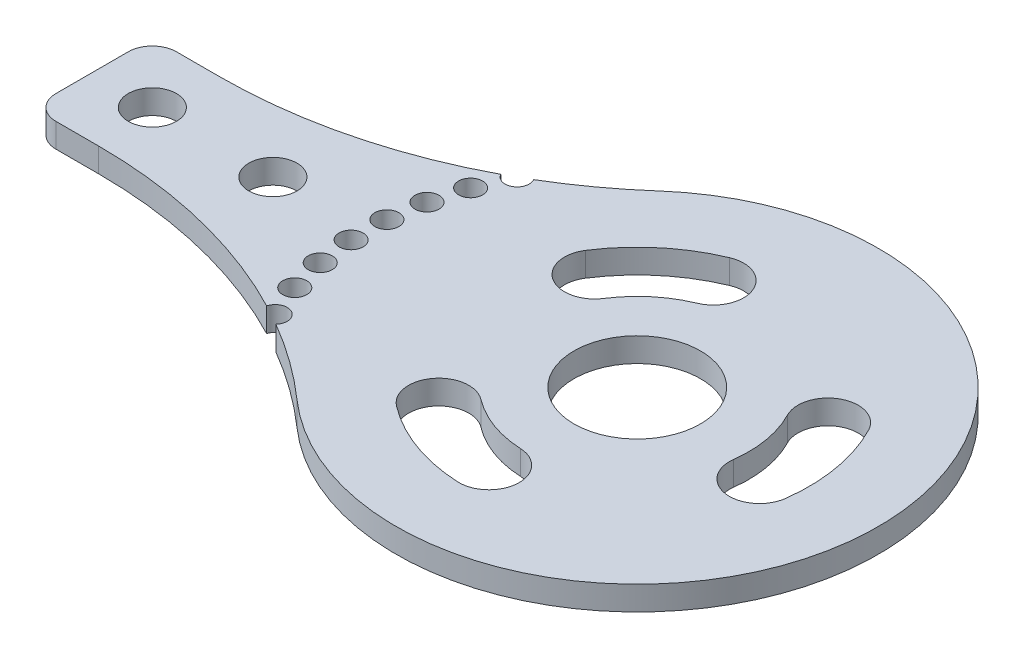
ISO-10303-21;
HEADER;
FILE_DESCRIPTION(('STEP AP214'),'2;1');
FILE_NAME('part.step','',(''),(''),'','','');
FILE_SCHEMA(('AUTOMOTIVE_DESIGN { 1 0 10303 214 1 1 1 1 }'));
ENDSEC;
DATA;
#1=APPLICATION_CONTEXT('core data for automotive mechanical design processes');
#2=APPLICATION_PROTOCOL_DEFINITION('international standard','automotive_design',2000,#1);
#3=PRODUCT_CONTEXT('',#1,'mechanical');
#4=PRODUCT('Part','Part','',(#3));
#5=PRODUCT_RELATED_PRODUCT_CATEGORY('part','',(#4));
#6=PRODUCT_DEFINITION_FORMATION('','',#4);
#7=PRODUCT_DEFINITION_CONTEXT('part definition',#1,'design');
#8=PRODUCT_DEFINITION('design','',#6,#7);
#9=PRODUCT_DEFINITION_SHAPE('','',#8);
#10=(LENGTH_UNIT() NAMED_UNIT(*) SI_UNIT(.MILLI.,.METRE.));
#11=(NAMED_UNIT(*) PLANE_ANGLE_UNIT() SI_UNIT($,.RADIAN.));
#12=(NAMED_UNIT(*) SI_UNIT($,.STERADIAN.) SOLID_ANGLE_UNIT());
#13=UNCERTAINTY_MEASURE_WITH_UNIT(LENGTH_MEASURE(1.E-05),#10,'distance_accuracy_value','');
#14=(GEOMETRIC_REPRESENTATION_CONTEXT(3) GLOBAL_UNCERTAINTY_ASSIGNED_CONTEXT((#13)) GLOBAL_UNIT_ASSIGNED_CONTEXT((#10,
#11,#12)) REPRESENTATION_CONTEXT('',''));
#15=CARTESIAN_POINT('',(0.,0.,0.));
#16=DIRECTION('',(0.,0.,1.));
#17=DIRECTION('',(1.,0.,0.));
#18=AXIS2_PLACEMENT_3D('',#15,#16,#17);
#19=CARTESIAN_POINT('',(5.5424868893541,2.,50.));
#20=DIRECTION('',(0.,-1.,0.));
#21=DIRECTION('',(0.,0.,-1.));
#22=AXIS2_PLACEMENT_3D('',#19,#20,#21);
#23=CYLINDRICAL_SURFACE('',#22,40.);
#24=CARTESIAN_POINT('',(5.5424868893541,2.,50.));
#25=DIRECTION('',(0.,-1.,0.));
#26=DIRECTION('',(0.,0.,-1.));
#27=AXIS2_PLACEMENT_3D('',#24,#25,#26);
#28=CIRCLE('',#27,40.);
#29=CARTESIAN_POINT('',(25.6994964834051,2.,15.4501090562454));
#30=VERTEX_POINT('',#29);
#31=CARTESIAN_POINT('',(32.,2.,20.));
#32=VERTEX_POINT('',#31);
#33=EDGE_CURVE('E367',#30,#32,#28,.T.);
#34=ORIENTED_EDGE('',*,*,#33,.F.);
#35=DIRECTION('',(0.,1.,0.));
#36=VECTOR('',#35,1.);
#37=CARTESIAN_POINT('',(25.6994964834051,1.,15.4501090562454));
#38=LINE('',#37,#36);
#39=CARTESIAN_POINT('',(25.6994964834051,0.,15.4501090562454));
#40=VERTEX_POINT('',#39);
#41=EDGE_CURVE('E315',#30,#40,#38,.F.);
#42=ORIENTED_EDGE('',*,*,#41,.T.);
#43=CARTESIAN_POINT('',(5.5424868893541,0.,50.));
#44=DIRECTION('',(0.,-1.,0.));
#45=DIRECTION('',(0.,0.,-1.));
#46=AXIS2_PLACEMENT_3D('',#43,#44,#45);
#47=CIRCLE('',#46,40.);
#48=CARTESIAN_POINT('',(32.,0.,20.));
#49=VERTEX_POINT('',#48);
#50=EDGE_CURVE('E362',#40,#49,#47,.T.);
#51=ORIENTED_EDGE('',*,*,#50,.T.);
#52=DIRECTION('',(0.,-1.,0.));
#53=VECTOR('',#52,1.);
#54=CARTESIAN_POINT('',(32.,2.,20.));
#55=LINE('',#54,#53);
#56=EDGE_CURVE('E423',#32,#49,#55,.T.);
#57=ORIENTED_EDGE('',*,*,#56,.F.);
#58=EDGE_LOOP('',(#34,#42,#51,#57));
#59=FACE_BOUND('',#58,.T.);
#60=ADVANCED_FACE('F36',(#59),#23,.F.);
#61=CARTESIAN_POINT('',(5.54248688935409,2.,-40.));
#62=DIRECTION('',(0.,-1.,0.));
#63=DIRECTION('',(0.,0.,-1.));
#64=AXIS2_PLACEMENT_3D('',#61,#62,#63);
#65=CYLINDRICAL_SURFACE('',#64,40.);
#66=CARTESIAN_POINT('',(5.54248688935409,2.,-40.));
#67=DIRECTION('',(0.,-1.,0.));
#68=DIRECTION('',(0.,0.,1.));
#69=AXIS2_PLACEMENT_3D('',#66,#67,#68);
#70=CIRCLE('',#69,40.);
#71=CARTESIAN_POINT('',(24.2593371705279,2.,-4.64919356574555));
#72=VERTEX_POINT('',#71);
#73=CARTESIAN_POINT('',(5.5424868893541,2.,0.));
#74=VERTEX_POINT('',#73);
#75=EDGE_CURVE('E369',#72,#74,#70,.T.);
#76=ORIENTED_EDGE('',*,*,#75,.F.);
#77=DIRECTION('',(0.,1.,0.));
#78=VECTOR('',#77,1.);
#79=CARTESIAN_POINT('',(24.2593371705279,1.,-4.64919356574555));
#80=LINE('',#79,#78);
#81=CARTESIAN_POINT('',(24.2593371705279,0.,-4.64919356574555));
#82=VERTEX_POINT('',#81);
#83=EDGE_CURVE('E359',#72,#82,#80,.F.);
#84=ORIENTED_EDGE('',*,*,#83,.T.);
#85=CARTESIAN_POINT('',(5.54248688935409,0.,-40.));
#86=DIRECTION('',(0.,-1.,0.));
#87=DIRECTION('',(0.,0.,1.));
#88=AXIS2_PLACEMENT_3D('',#85,#86,#87);
#89=CIRCLE('',#88,40.);
#90=CARTESIAN_POINT('',(5.5424868893541,0.,0.));
#91=VERTEX_POINT('',#90);
#92=EDGE_CURVE('E389',#82,#91,#89,.T.);
#93=ORIENTED_EDGE('',*,*,#92,.T.);
#94=DIRECTION('',(0.,-1.,0.));
#95=VECTOR('',#94,1.);
#96=CARTESIAN_POINT('',(5.5424868893541,2.,0.));
#97=LINE('',#96,#95);
#98=EDGE_CURVE('E417',#74,#91,#97,.T.);
#99=ORIENTED_EDGE('',*,*,#98,.F.);
#100=EDGE_LOOP('',(#76,#84,#93,#99));
#101=FACE_BOUND('',#100,.T.);
#102=ADVANCED_FACE('F434',(#101),#65,.F.);
#103=CARTESIAN_POINT('',(5.5424868893541,0.,10.));
#104=VERTEX_POINT('',#103);
#105=CARTESIAN_POINT('',(23.9976028764144,0.,14.5118513598673));
#106=VERTEX_POINT('',#105);
#107=EDGE_CURVE('E384',#104,#106,#47,.T.);
#108=ORIENTED_EDGE('',*,*,#107,.T.);
#109=DIRECTION('',(0.,1.,0.));
#110=VECTOR('',#109,1.);
#111=CARTESIAN_POINT('',(23.9976028764144,1.,14.5118513598673));
#112=LINE('',#111,#110);
#113=CARTESIAN_POINT('',(23.9976028764144,2.,14.5118513598673));
#114=VERTEX_POINT('',#113);
#115=EDGE_CURVE('E312',#106,#114,#112,.T.);
#116=ORIENTED_EDGE('',*,*,#115,.T.);
#117=CARTESIAN_POINT('',(5.5424868893541,2.,10.));
#118=VERTEX_POINT('',#117);
#119=EDGE_CURVE('E363',#118,#114,#28,.T.);
#120=ORIENTED_EDGE('',*,*,#119,.F.);
#121=DIRECTION('',(0.,-1.,0.));
#122=VECTOR('',#121,1.);
#123=CARTESIAN_POINT('',(5.5424868893541,2.,10.));
#124=LINE('',#123,#122);
#125=EDGE_CURVE('E383',#118,#104,#124,.T.);
#126=ORIENTED_EDGE('',*,*,#125,.T.);
#127=EDGE_LOOP('',(#108,#116,#120,#126));
#128=FACE_BOUND('',#127,.T.);
#129=ADVANCED_FACE('F38',(#128),#23,.F.);
#130=CARTESIAN_POINT('',(45.228756555323,2.,5.));
#131=DIRECTION('',(0.,-1.,0.));
#132=DIRECTION('',(0.,0.,-1.));
#133=AXIS2_PLACEMENT_3D('',#130,#131,#132);
#134=CYLINDRICAL_SURFACE('',#133,20.);
#135=CARTESIAN_POINT('',(45.228756555323,0.,5.));
#136=DIRECTION('',(0.,1.,0.));
#137=DIRECTION('',(0.,0.,1.));
#138=AXIS2_PLACEMENT_3D('',#135,#136,#137);
#139=CIRCLE('',#138,20.);
#140=CARTESIAN_POINT('',(32.,0.,-10.));
#141=VERTEX_POINT('',#140);
#142=EDGE_CURVE('E387',#49,#141,#139,.T.);
#143=ORIENTED_EDGE('',*,*,#142,.T.);
#144=DIRECTION('',(0.,-1.,0.));
#145=VECTOR('',#144,1.);
#146=CARTESIAN_POINT('',(32.,2.,-10.));
#147=LINE('',#146,#145);
#148=CARTESIAN_POINT('',(32.,2.,-10.));
#149=VERTEX_POINT('',#148);
#150=EDGE_CURVE('E420',#149,#141,#147,.T.);
#151=ORIENTED_EDGE('',*,*,#150,.F.);
#152=CARTESIAN_POINT('',(45.228756555323,2.,5.));
#153=DIRECTION('',(0.,1.,0.));
#154=DIRECTION('',(0.,0.,1.));
#155=AXIS2_PLACEMENT_3D('',#152,#153,#154);
#156=CIRCLE('',#155,20.);
#157=EDGE_CURVE('E366',#32,#149,#156,.T.);
#158=ORIENTED_EDGE('',*,*,#157,.F.);
#159=ORIENTED_EDGE('',*,*,#56,.T.);
#160=EDGE_LOOP('',(#143,#151,#158,#159));
#161=FACE_BOUND('',#160,.T.);
#162=ADVANCED_FACE('F462',(#161),#134,.T.);
#163=CARTESIAN_POINT('',(26.0027946773458,0.,-5.62885213990304));
#164=VERTEX_POINT('',#163);
#165=EDGE_CURVE('E390',#141,#164,#89,.T.);
#166=ORIENTED_EDGE('',*,*,#165,.T.);
#167=DIRECTION('',(0.,1.,0.));
#168=VECTOR('',#167,1.);
#169=CARTESIAN_POINT('',(26.0027946773458,1.,-5.62885213990304));
#170=LINE('',#169,#168);
#171=CARTESIAN_POINT('',(26.0027946773458,2.,-5.62885213990304));
#172=VERTEX_POINT('',#171);
#173=EDGE_CURVE('E356',#164,#172,#170,.T.);
#174=ORIENTED_EDGE('',*,*,#173,.T.);
#175=EDGE_CURVE('E370',#149,#172,#70,.T.);
#176=ORIENTED_EDGE('',*,*,#175,.F.);
#177=ORIENTED_EDGE('',*,*,#150,.T.);
#178=EDGE_LOOP('',(#166,#174,#176,#177));
#179=FACE_BOUND('',#178,.T.);
#180=ADVANCED_FACE('F455',(#179),#65,.F.);
#181=CARTESIAN_POINT('',(2.00000000000001,2.,0.));
#182=DIRECTION('',(0.,0.,1.));
#183=DIRECTION('',(1.,0.,0.));
#184=AXIS2_PLACEMENT_3D('',#181,#182,#183);
#185=PLANE('',#184);
#186=DIRECTION('',(-1.,0.,0.));
#187=VECTOR('',#186,1.);
#188=CARTESIAN_POINT('',(2.00000000000001,0.,0.));
#189=LINE('',#188,#187);
#190=CARTESIAN_POINT('',(2.00000000000001,0.,0.));
#191=VERTEX_POINT('',#190);
#192=EDGE_CURVE('E393',#91,#191,#189,.T.);
#193=ORIENTED_EDGE('',*,*,#192,.T.);
#194=DIRECTION('',(0.,-1.,0.));
#195=VECTOR('',#194,1.);
#196=CARTESIAN_POINT('',(2.00000000000001,2.,0.));
#197=LINE('',#196,#195);
#198=CARTESIAN_POINT('',(2.00000000000001,2.,0.));
#199=VERTEX_POINT('',#198);
#200=EDGE_CURVE('E414',#199,#191,#197,.T.);
#201=ORIENTED_EDGE('',*,*,#200,.F.);
#202=DIRECTION('',(-1.,0.,0.));
#203=VECTOR('',#202,1.);
#204=CARTESIAN_POINT('',(2.00000000000001,2.,0.));
#205=LINE('',#204,#203);
#206=EDGE_CURVE('E373',#74,#199,#205,.T.);
#207=ORIENTED_EDGE('',*,*,#206,.F.);
#208=ORIENTED_EDGE('',*,*,#98,.T.);
#209=EDGE_LOOP('',(#193,#201,#207,#208));
#210=FACE_BOUND('',#209,.T.);
#211=ADVANCED_FACE('F443',(#210),#185,.F.);
#212=CARTESIAN_POINT('',(2.,2.,2.));
#213=DIRECTION('',(0.,-1.,0.));
#214=DIRECTION('',(0.,0.,-1.));
#215=AXIS2_PLACEMENT_3D('',#212,#213,#214);
#216=CYLINDRICAL_SURFACE('',#215,2.);
#217=CARTESIAN_POINT('',(2.,0.,2.));
#218=DIRECTION('',(0.,1.,0.));
#219=DIRECTION('',(0.,0.,-1.));
#220=AXIS2_PLACEMENT_3D('',#217,#218,#219);
#221=CIRCLE('',#220,2.);
#222=CARTESIAN_POINT('',(0.,0.,2.00000000000001));
#223=VERTEX_POINT('',#222);
#224=EDGE_CURVE('E395',#191,#223,#221,.T.);
#225=ORIENTED_EDGE('',*,*,#224,.T.);
#226=DIRECTION('',(0.,-1.,0.));
#227=VECTOR('',#226,1.);
#228=CARTESIAN_POINT('',(0.,2.,2.00000000000001));
#229=LINE('',#228,#227);
#230=CARTESIAN_POINT('',(0.,2.,2.00000000000001));
#231=VERTEX_POINT('',#230);
#232=EDGE_CURVE('E411',#231,#223,#229,.T.);
#233=ORIENTED_EDGE('',*,*,#232,.F.);
#234=CARTESIAN_POINT('',(2.,2.,2.));
#235=DIRECTION('',(0.,1.,0.));
#236=DIRECTION('',(0.,0.,-1.));
#237=AXIS2_PLACEMENT_3D('',#234,#235,#236);
#238=CIRCLE('',#237,2.);
#239=EDGE_CURVE('E375',#199,#231,#238,.T.);
#240=ORIENTED_EDGE('',*,*,#239,.F.);
#241=ORIENTED_EDGE('',*,*,#200,.T.);
#242=EDGE_LOOP('',(#225,#233,#240,#241));
#243=FACE_BOUND('',#242,.T.);
#244=ADVANCED_FACE('F447',(#243),#216,.T.);
#245=CARTESIAN_POINT('',(0.,2.,2.00000000000001));
#246=DIRECTION('',(1.,0.,0.));
#247=DIRECTION('',(0.,0.,-1.));
#248=AXIS2_PLACEMENT_3D('',#245,#246,#247);
#249=PLANE('',#248);
#250=DIRECTION('',(0.,0.,1.));
#251=VECTOR('',#250,1.);
#252=CARTESIAN_POINT('',(0.,0.,2.00000000000001));
#253=LINE('',#252,#251);
#254=CARTESIAN_POINT('',(0.,0.,7.99999999999999));
#255=VERTEX_POINT('',#254);
#256=EDGE_CURVE('E397',#223,#255,#253,.T.);
#257=ORIENTED_EDGE('',*,*,#256,.T.);
#258=DIRECTION('',(0.,-1.,0.));
#259=VECTOR('',#258,1.);
#260=CARTESIAN_POINT('',(0.,2.,7.99999999999999));
#261=LINE('',#260,#259);
#262=CARTESIAN_POINT('',(0.,2.,7.99999999999999));
#263=VERTEX_POINT('',#262);
#264=EDGE_CURVE('E408',#263,#255,#261,.T.);
#265=ORIENTED_EDGE('',*,*,#264,.F.);
#266=DIRECTION('',(0.,0.,1.));
#267=VECTOR('',#266,1.);
#268=CARTESIAN_POINT('',(0.,2.,2.00000000000001));
#269=LINE('',#268,#267);
#270=EDGE_CURVE('E377',#231,#263,#269,.T.);
#271=ORIENTED_EDGE('',*,*,#270,.F.);
#272=ORIENTED_EDGE('',*,*,#232,.T.);
#273=EDGE_LOOP('',(#257,#265,#271,#272));
#274=FACE_BOUND('',#273,.T.);
#275=ADVANCED_FACE('F482',(#274),#249,.F.);
#276=CARTESIAN_POINT('',(2.,2.,8.));
#277=DIRECTION('',(0.,-1.,0.));
#278=DIRECTION('',(0.,0.,-1.));
#279=AXIS2_PLACEMENT_3D('',#276,#277,#278);
#280=CYLINDRICAL_SURFACE('',#279,2.);
#281=CARTESIAN_POINT('',(2.,0.,8.));
#282=DIRECTION('',(0.,1.,0.));
#283=DIRECTION('',(0.,0.,1.));
#284=AXIS2_PLACEMENT_3D('',#281,#282,#283);
#285=CIRCLE('',#284,2.);
#286=CARTESIAN_POINT('',(2.00000000000002,0.,10.));
#287=VERTEX_POINT('',#286);
#288=EDGE_CURVE('E399',#255,#287,#285,.T.);
#289=ORIENTED_EDGE('',*,*,#288,.T.);
#290=DIRECTION('',(0.,-1.,0.));
#291=VECTOR('',#290,1.);
#292=CARTESIAN_POINT('',(2.00000000000002,2.,10.));
#293=LINE('',#292,#291);
#294=CARTESIAN_POINT('',(2.00000000000002,2.,10.));
#295=VERTEX_POINT('',#294);
#296=EDGE_CURVE('E405',#295,#287,#293,.T.);
#297=ORIENTED_EDGE('',*,*,#296,.F.);
#298=CARTESIAN_POINT('',(2.,2.,8.));
#299=DIRECTION('',(0.,1.,0.));
#300=DIRECTION('',(0.,0.,1.));
#301=AXIS2_PLACEMENT_3D('',#298,#299,#300);
#302=CIRCLE('',#301,2.);
#303=EDGE_CURVE('E379',#263,#295,#302,.T.);
#304=ORIENTED_EDGE('',*,*,#303,.F.);
#305=ORIENTED_EDGE('',*,*,#264,.T.);
#306=EDGE_LOOP('',(#289,#297,#304,#305));
#307=FACE_BOUND('',#306,.T.);
#308=ADVANCED_FACE('F480',(#307),#280,.T.);
#309=CARTESIAN_POINT('',(2.00000000000002,2.,10.));
#310=DIRECTION('',(0.,0.,-1.));
#311=DIRECTION('',(-1.,0.,0.));
#312=AXIS2_PLACEMENT_3D('',#309,#310,#311);
#313=PLANE('',#312);
#314=DIRECTION('',(1.,0.,0.));
#315=VECTOR('',#314,1.);
#316=CARTESIAN_POINT('',(2.00000000000002,0.,10.));
#317=LINE('',#316,#315);
#318=EDGE_CURVE('E401',#287,#104,#317,.T.);
#319=ORIENTED_EDGE('',*,*,#318,.T.);
#320=ORIENTED_EDGE('',*,*,#125,.F.);
#321=DIRECTION('',(1.,0.,0.));
#322=VECTOR('',#321,1.);
#323=CARTESIAN_POINT('',(2.00000000000002,2.,10.));
#324=LINE('',#323,#322);
#325=EDGE_CURVE('E381',#295,#118,#324,.T.);
#326=ORIENTED_EDGE('',*,*,#325,.F.);
#327=ORIENTED_EDGE('',*,*,#296,.T.);
#328=EDGE_LOOP('',(#319,#320,#326,#327));
#329=FACE_BOUND('',#328,.T.);
#330=ADVANCED_FACE('F476',(#329),#313,.F.);
#331=CARTESIAN_POINT('',(5.5424868893541,2.,50.));
#332=DIRECTION('',(0.,-1.,0.));
#333=DIRECTION('',(0.,0.,-1.));
#334=AXIS2_PLACEMENT_3D('',#331,#332,#333);
#335=PLANE('',#334);
#336=CARTESIAN_POINT('',(45.228756555323,2.,5.));
#337=DIRECTION('',(0.,1.,0.));
#338=DIRECTION('',(0.,0.,1.));
#339=AXIS2_PLACEMENT_3D('',#336,#337,#338);
#340=CIRCLE('',#339,5.25);
#341=CARTESIAN_POINT('',(45.228756555323,2.,10.25));
#342=VERTEX_POINT('',#341);
#343=EDGE_CURVE('E220',#342,#342,#340,.T.);
#344=ORIENTED_EDGE('',*,*,#343,.F.);
#345=EDGE_LOOP('',(#344));
#346=FACE_BOUND('',#345,.T.);
#347=CARTESIAN_POINT('',(45.228756555323,2.,5.));
#348=DIRECTION('',(0.,1.,0.));
#349=DIRECTION('',(-0.866025403784443,0.,-0.499999999999992));
#350=AXIS2_PLACEMENT_3D('',#347,#348,#349);
#351=CIRCLE('',#350,9.2498831504514);
#352=CARTESIAN_POINT('',(54.402108574257,2.,6.18741359000272));
#353=VERTEX_POINT('',#352);
#354=CARTESIAN_POINT('',(53.4495007890298,2.,0.759752066095645));
#355=VERTEX_POINT('',#354);
#356=EDGE_CURVE('E226',#353,#355,#351,.T.);
#357=ORIENTED_EDGE('',*,*,#356,.T.);
#358=CARTESIAN_POINT('',(55.6713516221686,2.,-0.386275366071824));
#359=DIRECTION('',(0.,1.,0.));
#360=DIRECTION('',(-0.866025403784443,0.,-0.499999999999992));
#361=AXIS2_PLACEMENT_3D('',#358,#359,#360);
#362=CIRCLE('',#361,2.5);
#363=CARTESIAN_POINT('',(57.8932024553075,2.,-1.53230279823927));
#364=VERTEX_POINT('',#363);
#365=EDGE_CURVE('E51',#364,#355,#362,.T.);
#366=ORIENTED_EDGE('',*,*,#365,.F.);
#367=CARTESIAN_POINT('',(45.228756555323,2.,5.));
#368=DIRECTION('',(0.,1.,0.));
#369=DIRECTION('',(-0.866025403784443,0.,-0.499999999999992));
#370=AXIS2_PLACEMENT_3D('',#367,#368,#369);
#371=CIRCLE('',#370,14.2498831504514);
#372=CARTESIAN_POINT('',(59.3607398724731,2.,6.82926688192499));
#373=VERTEX_POINT('',#372);
#374=EDGE_CURVE('E214',#373,#364,#371,.T.);
#375=ORIENTED_EDGE('',*,*,#374,.F.);
#376=CARTESIAN_POINT('',(56.8814242233651,2.,6.50834023596385));
#377=DIRECTION('',(0.,1.,0.));
#378=DIRECTION('',(-0.866025403784443,0.,-0.499999999999992));
#379=AXIS2_PLACEMENT_3D('',#376,#377,#378);
#380=CIRCLE('',#379,2.5);
#381=EDGE_CURVE('E217',#353,#373,#380,.T.);
#382=ORIENTED_EDGE('',*,*,#381,.F.);
#383=EDGE_LOOP('',(#357,#366,#375,#382));
#384=FACE_BOUND('',#383,.T.);
#385=CARTESIAN_POINT('',(45.228756555323,2.,5.));
#386=DIRECTION('',(0.,1.,0.));
#387=DIRECTION('',(0.866025403784436,0.,-0.500000000000004));
#388=AXIS2_PLACEMENT_3D('',#385,#386,#387);
#389=CIRCLE('',#388,9.2498831504514);
#390=CARTESIAN_POINT('',(39.6137502121147,2.,12.3506490912528));
#391=VERTEX_POINT('',#390);
#392=CARTESIAN_POINT('',(44.7905468675751,2.,14.2394973113568));
#393=VERTEX_POINT('',#392);
#394=EDGE_CURVE('E251',#391,#393,#389,.T.);
#395=ORIENTED_EDGE('',*,*,#394,.T.);
#396=CARTESIAN_POINT('',(44.6721103206966,2.,16.7366902923583));
#397=DIRECTION('',(0.,1.,0.));
#398=DIRECTION('',(0.866025403784436,0.,-0.500000000000004));
#399=AXIS2_PLACEMENT_3D('',#396,#397,#398);
#400=CIRCLE('',#399,2.5);
#401=CARTESIAN_POINT('',(44.553673773818,2.,19.2338832733599));
#402=VERTEX_POINT('',#401);
#403=EDGE_CURVE('E233',#402,#393,#400,.T.);
#404=ORIENTED_EDGE('',*,*,#403,.F.);
#405=CARTESIAN_POINT('',(45.228756555323,2.,5.));
#406=DIRECTION('',(0.,1.,0.));
#407=DIRECTION('',(0.866025403784436,0.,-0.500000000000004));
#408=AXIS2_PLACEMENT_3D('',#405,#406,#407);
#409=CIRCLE('',#408,14.2498831504514);
#410=CARTESIAN_POINT('',(36.5785733066992,2.,16.3240231175474));
#411=VERTEX_POINT('',#410);
#412=EDGE_CURVE('E241',#411,#402,#409,.T.);
#413=ORIENTED_EDGE('',*,*,#412,.F.);
#414=CARTESIAN_POINT('',(38.096161759407,2.,14.3373361044001));
#415=DIRECTION('',(0.,1.,0.));
#416=DIRECTION('',(0.866025403784436,0.,-0.500000000000004));
#417=AXIS2_PLACEMENT_3D('',#414,#415,#416);
#418=CIRCLE('',#417,2.5);
#419=EDGE_CURVE('E254',#391,#411,#418,.T.);
#420=ORIENTED_EDGE('',*,*,#419,.F.);
#421=EDGE_LOOP('',(#395,#404,#413,#420));
#422=FACE_BOUND('',#421,.T.);
#423=CARTESIAN_POINT('',(45.228756555323,2.,5.));
#424=DIRECTION('',(0.,1.,0.));
#425=DIRECTION('',(0.,0.,1.));
#426=AXIS2_PLACEMENT_3D('',#423,#424,#425);
#427=CIRCLE('',#426,9.2498831504514);
#428=CARTESIAN_POINT('',(41.6704108795972,2.,-3.53806268125556));
#429=VERTEX_POINT('',#428);
#430=CARTESIAN_POINT('',(37.4462220093639,2.,0.000750622547521229));
#431=VERTEX_POINT('',#430);
#432=EDGE_CURVE('E282',#429,#431,#427,.T.);
#433=ORIENTED_EDGE('',*,*,#432,.T.);
#434=CARTESIAN_POINT('',(35.3428077231037,2.,-1.3504149262866));
#435=DIRECTION('',(0.,1.,0.));
#436=DIRECTION('',(0.,0.,1.));
#437=AXIS2_PLACEMENT_3D('',#434,#435,#436);
#438=CIRCLE('',#437,2.5);
#439=CARTESIAN_POINT('',(33.2393934368434,2.,-2.70158047512074));
#440=VERTEX_POINT('',#439);
#441=EDGE_CURVE('E261',#440,#431,#438,.T.);
#442=ORIENTED_EDGE('',*,*,#441,.F.);
#443=CARTESIAN_POINT('',(45.228756555323,2.,5.));
#444=DIRECTION('',(0.,1.,0.));
#445=DIRECTION('',(0.,0.,1.));
#446=AXIS2_PLACEMENT_3D('',#443,#444,#445);
#447=CIRCLE('',#446,14.2498831504514);
#448=CARTESIAN_POINT('',(39.7469564867966,2.,-8.15328999947249));
#449=VERTEX_POINT('',#448);
#450=EDGE_CURVE('E272',#449,#440,#447,.T.);
#451=ORIENTED_EDGE('',*,*,#450,.F.);
#452=CARTESIAN_POINT('',(40.7086836831969,2.,-5.84567634036403));
#453=DIRECTION('',(0.,1.,0.));
#454=DIRECTION('',(0.,0.,1.));
#455=AXIS2_PLACEMENT_3D('',#452,#453,#454);
#456=CIRCLE('',#455,2.5);
#457=EDGE_CURVE('E285',#429,#449,#456,.T.);
#458=ORIENTED_EDGE('',*,*,#457,.F.);
#459=EDGE_LOOP('',(#433,#442,#451,#458));
#460=FACE_BOUND('',#459,.T.);
#461=CARTESIAN_POINT('',(15.,2.,5.));
#462=DIRECTION('',(0.,1.,0.));
#463=DIRECTION('',(0.,0.,1.));
#464=AXIS2_PLACEMENT_3D('',#461,#462,#463);
#465=CIRCLE('',#464,2.);
#466=CARTESIAN_POINT('',(15.,2.,7.));
#467=VERTEX_POINT('',#466);
#468=EDGE_CURVE('E292',#467,#467,#465,.T.);
#469=ORIENTED_EDGE('',*,*,#468,.F.);
#470=EDGE_LOOP('',(#469));
#471=FACE_BOUND('',#470,.T.);
#472=CARTESIAN_POINT('',(5.,2.,5.));
#473=DIRECTION('',(0.,1.,0.));
#474=DIRECTION('',(0.,0.,1.));
#475=AXIS2_PLACEMENT_3D('',#472,#473,#474);
#476=CIRCLE('',#475,2.);
#477=CARTESIAN_POINT('',(5.,2.,7.));
#478=VERTEX_POINT('',#477);
#479=EDGE_CURVE('E302',#478,#478,#476,.T.);
#480=ORIENTED_EDGE('',*,*,#479,.F.);
#481=EDGE_LOOP('',(#480));
#482=FACE_BOUND('',#481,.T.);
#483=CARTESIAN_POINT('',(23.8602069366979,2.,12.0452173278302));
#484=DIRECTION('',(0.,1.,0.));
#485=DIRECTION('',(0.707106781186549,0.,0.707106781186546));
#486=AXIS2_PLACEMENT_3D('',#483,#484,#485);
#487=CIRCLE('',#486,0.999999999999998);
#488=CARTESIAN_POINT('',(24.5673137178845,2.,12.7523241090168));
#489=VERTEX_POINT('',#488);
#490=EDGE_CURVE('E318',#489,#489,#487,.T.);
#491=ORIENTED_EDGE('',*,*,#490,.F.);
#492=EDGE_LOOP('',(#491));
#493=FACE_BOUND('',#492,.T.);
#494=CARTESIAN_POINT('',(23.1234324497615,2.,9.19578910195463));
#495=DIRECTION('',(0.,1.,0.));
#496=DIRECTION('',(0.608761429008722,0.,0.793353340291234));
#497=AXIS2_PLACEMENT_3D('',#494,#495,#496);
#498=CIRCLE('',#497,0.999999999999998);
#499=CARTESIAN_POINT('',(23.7321938787702,2.,9.98914244224586));
#500=VERTEX_POINT('',#499);
#501=EDGE_CURVE('E322',#500,#500,#498,.T.);
#502=ORIENTED_EDGE('',*,*,#501,.F.);
#503=EDGE_LOOP('',(#502));
#504=FACE_BOUND('',#503,.T.);
#505=CARTESIAN_POINT('',(22.7648861870249,2.,6.27456976125209));
#506=DIRECTION('',(0.,1.,0.));
#507=DIRECTION('',(0.500000000000001,0.,0.866025403784438));
#508=AXIS2_PLACEMENT_3D('',#505,#506,#507);
#509=CIRCLE('',#508,0.999999999999998);
#510=CARTESIAN_POINT('',(23.2648861870249,2.,7.14059516503652));
#511=VERTEX_POINT('',#510);
#512=EDGE_CURVE('E328',#511,#511,#509,.T.);
#513=ORIENTED_EDGE('',*,*,#512,.F.);
#514=EDGE_LOOP('',(#513));
#515=FACE_BOUND('',#514,.T.);
#516=CARTESIAN_POINT('',(22.7907029744513,2.,3.33154217855702));
#517=DIRECTION('',(0.,1.,0.));
#518=DIRECTION('',(0.382683432365091,0.,0.923879532511287));
#519=AXIS2_PLACEMENT_3D('',#516,#517,#518);
#520=CIRCLE('',#519,0.999999999999998);
#521=CARTESIAN_POINT('',(23.1733864068164,2.,4.25542171106831));
#522=VERTEX_POINT('',#521);
#523=EDGE_CURVE('E334',#522,#522,#520,.T.);
#524=ORIENTED_EDGE('',*,*,#523,.F.);
#525=EDGE_LOOP('',(#524));
#526=FACE_BOUND('',#525,.T.);
#527=CARTESIAN_POINT('',(23.2004410796503,2.,0.417062371770745));
#528=DIRECTION('',(0.,1.,0.));
#529=DIRECTION('',(0.258819045102521,0.,0.965925826289068));
#530=AXIS2_PLACEMENT_3D('',#527,#528,#529);
#531=CIRCLE('',#530,0.999999999999998);
#532=CARTESIAN_POINT('',(23.4592601247528,2.,1.38298819805981));
#533=VERTEX_POINT('',#532);
#534=EDGE_CURVE('E340',#533,#533,#531,.T.);
#535=ORIENTED_EDGE('',*,*,#534,.F.);
#536=EDGE_LOOP('',(#535));
#537=FACE_BOUND('',#536,.T.);
#538=CARTESIAN_POINT('',(23.9870897700409,2.,-2.41900210156617));
#539=DIRECTION('',(0.,1.,0.));
#540=DIRECTION('',(0.130526192220052,0.,0.99144486137381));
#541=AXIS2_PLACEMENT_3D('',#538,#539,#540);
#542=CIRCLE('',#541,0.999999999999998);
#543=CARTESIAN_POINT('',(24.1176159622609,2.,-1.42755724019236));
#544=VERTEX_POINT('',#543);
#545=EDGE_CURVE('E346',#544,#544,#542,.T.);
#546=ORIENTED_EDGE('',*,*,#545,.F.);
#547=EDGE_LOOP('',(#546));
#548=FACE_BOUND('',#547,.T.);
#549=ORIENTED_EDGE('',*,*,#119,.T.);
#550=CARTESIAN_POINT('',(24.9626032320903,2.,14.7740999319234));
#551=DIRECTION('',(0.,1.,0.));
#552=DIRECTION('',(0.793353340291236,0.,0.608761429008719));
#553=AXIS2_PLACEMENT_3D('',#550,#551,#552);
#554=CIRCLE('',#553,0.999999999999998);
#555=EDGE_CURVE('E308',#30,#114,#554,.T.);
#556=ORIENTED_EDGE('',*,*,#555,.F.);
#557=ORIENTED_EDGE('',*,*,#33,.T.);
#558=ORIENTED_EDGE('',*,*,#157,.T.);
#559=ORIENTED_EDGE('',*,*,#175,.T.);
#560=CARTESIAN_POINT('',(25.1371892684303,2.,-5.1281253920093));
#561=DIRECTION('',(0.,1.,0.));
#562=DIRECTION('',(0.,0.,1.));
#563=AXIS2_PLACEMENT_3D('',#560,#561,#562);
#564=CIRCLE('',#563,0.999999999999998);
#565=EDGE_CURVE('E352',#72,#172,#564,.T.);
#566=ORIENTED_EDGE('',*,*,#565,.F.);
#567=ORIENTED_EDGE('',*,*,#75,.T.);
#568=ORIENTED_EDGE('',*,*,#206,.T.);
#569=ORIENTED_EDGE('',*,*,#239,.T.);
#570=ORIENTED_EDGE('',*,*,#270,.T.);
#571=ORIENTED_EDGE('',*,*,#303,.T.);
#572=ORIENTED_EDGE('',*,*,#325,.T.);
#573=EDGE_LOOP('',(#549,#556,#557,#558,#559,#566,#567,#568,#569,#570,#571,#572));
#574=FACE_BOUND('',#573,.T.);
#575=ADVANCED_FACE('F451',(#346,#384,#422,#460,#471,#482,#493,#504,#515,#526,#537,#548,#574),
#335,.F.);
#576=CARTESIAN_POINT('',(5.5424868893541,0.,50.));
#577=DIRECTION('',(0.,-1.,0.));
#578=DIRECTION('',(0.,0.,-1.));
#579=AXIS2_PLACEMENT_3D('',#576,#577,#578);
#580=PLANE('',#579);
#581=CARTESIAN_POINT('',(45.228756555323,0.,5.));
#582=DIRECTION('',(0.,1.,0.));
#583=DIRECTION('',(0.,0.,1.));
#584=AXIS2_PLACEMENT_3D('',#581,#582,#583);
#585=CIRCLE('',#584,5.25);
#586=CARTESIAN_POINT('',(45.228756555323,0.,10.25));
#587=VERTEX_POINT('',#586);
#588=EDGE_CURVE('E227',#587,#587,#585,.T.);
#589=ORIENTED_EDGE('',*,*,#588,.T.);
#590=EDGE_LOOP('',(#589));
#591=FACE_BOUND('',#590,.T.);
#592=CARTESIAN_POINT('',(55.6713516221686,0.,-0.386275366071824));
#593=DIRECTION('',(0.,1.,0.));
#594=DIRECTION('',(-0.866025403784443,0.,-0.499999999999992));
#595=AXIS2_PLACEMENT_3D('',#592,#593,#594);
#596=CIRCLE('',#595,2.5);
#597=CARTESIAN_POINT('',(57.8932024553075,0.,-1.53230279823927));
#598=VERTEX_POINT('',#597);
#599=CARTESIAN_POINT('',(53.4495007890298,0.,0.759752066095645));
#600=VERTEX_POINT('',#599);
#601=EDGE_CURVE('E204',#598,#600,#596,.T.);
#602=ORIENTED_EDGE('',*,*,#601,.T.);
#603=CARTESIAN_POINT('',(45.228756555323,0.,5.));
#604=DIRECTION('',(0.,1.,0.));
#605=DIRECTION('',(-0.866025403784443,0.,-0.499999999999992));
#606=AXIS2_PLACEMENT_3D('',#603,#604,#605);
#607=CIRCLE('',#606,9.2498831504514);
#608=CARTESIAN_POINT('',(54.402108574257,0.,6.18741359000272));
#609=VERTEX_POINT('',#608);
#610=EDGE_CURVE('E196',#609,#600,#607,.T.);
#611=ORIENTED_EDGE('',*,*,#610,.F.);
#612=CARTESIAN_POINT('',(56.8814242233651,0.,6.50834023596385));
#613=DIRECTION('',(0.,1.,0.));
#614=DIRECTION('',(-0.866025403784443,0.,-0.499999999999992));
#615=AXIS2_PLACEMENT_3D('',#612,#613,#614);
#616=CIRCLE('',#615,2.5);
#617=CARTESIAN_POINT('',(59.3607398724731,0.,6.82926688192499));
#618=VERTEX_POINT('',#617);
#619=EDGE_CURVE('E59',#609,#618,#616,.T.);
#620=ORIENTED_EDGE('',*,*,#619,.T.);
#621=CARTESIAN_POINT('',(45.228756555323,0.,5.));
#622=DIRECTION('',(0.,1.,0.));
#623=DIRECTION('',(-0.866025403784443,0.,-0.499999999999992));
#624=AXIS2_PLACEMENT_3D('',#621,#622,#623);
#625=CIRCLE('',#624,14.2498831504514);
#626=EDGE_CURVE('E209',#618,#598,#625,.T.);
#627=ORIENTED_EDGE('',*,*,#626,.T.);
#628=EDGE_LOOP('',(#602,#611,#620,#627));
#629=FACE_BOUND('',#628,.T.);
#630=CARTESIAN_POINT('',(44.6721103206966,0.,16.7366902923583));
#631=DIRECTION('',(0.,1.,0.));
#632=DIRECTION('',(0.866025403784436,0.,-0.500000000000004));
#633=AXIS2_PLACEMENT_3D('',#630,#631,#632);
#634=CIRCLE('',#633,2.5);
#635=CARTESIAN_POINT('',(44.553673773818,0.,19.2338832733599));
#636=VERTEX_POINT('',#635);
#637=CARTESIAN_POINT('',(44.7905468675751,0.,14.2394973113568));
#638=VERTEX_POINT('',#637);
#639=EDGE_CURVE('E237',#636,#638,#634,.T.);
#640=ORIENTED_EDGE('',*,*,#639,.T.);
#641=CARTESIAN_POINT('',(45.228756555323,0.,5.));
#642=DIRECTION('',(0.,1.,0.));
#643=DIRECTION('',(0.866025403784436,0.,-0.500000000000004));
#644=AXIS2_PLACEMENT_3D('',#641,#642,#643);
#645=CIRCLE('',#644,9.2498831504514);
#646=CARTESIAN_POINT('',(39.6137502121147,0.,12.3506490912528));
#647=VERTEX_POINT('',#646);
#648=EDGE_CURVE('E240',#647,#638,#645,.T.);
#649=ORIENTED_EDGE('',*,*,#648,.F.);
#650=CARTESIAN_POINT('',(38.096161759407,0.,14.3373361044001));
#651=DIRECTION('',(0.,1.,0.));
#652=DIRECTION('',(0.866025403784436,0.,-0.500000000000004));
#653=AXIS2_PLACEMENT_3D('',#650,#651,#652);
#654=CIRCLE('',#653,2.5);
#655=CARTESIAN_POINT('',(36.5785733066992,0.,16.3240231175474));
#656=VERTEX_POINT('',#655);
#657=EDGE_CURVE('E243',#647,#656,#654,.T.);
#658=ORIENTED_EDGE('',*,*,#657,.T.);
#659=CARTESIAN_POINT('',(45.228756555323,0.,5.));
#660=DIRECTION('',(0.,1.,0.));
#661=DIRECTION('',(0.866025403784436,0.,-0.500000000000004));
#662=AXIS2_PLACEMENT_3D('',#659,#660,#661);
#663=CIRCLE('',#662,14.2498831504514);
#664=EDGE_CURVE('E246',#656,#636,#663,.T.);
#665=ORIENTED_EDGE('',*,*,#664,.T.);
#666=EDGE_LOOP('',(#640,#649,#658,#665));
#667=FACE_BOUND('',#666,.T.);
#668=CARTESIAN_POINT('',(35.3428077231037,0.,-1.3504149262866));
#669=DIRECTION('',(0.,1.,0.));
#670=DIRECTION('',(0.,0.,1.));
#671=AXIS2_PLACEMENT_3D('',#668,#669,#670);
#672=CIRCLE('',#671,2.5);
#673=CARTESIAN_POINT('',(33.2393934368434,0.,-2.70158047512074));
#674=VERTEX_POINT('',#673);
#675=CARTESIAN_POINT('',(37.4462220093639,0.,0.000750622547519494));
#676=VERTEX_POINT('',#675);
#677=EDGE_CURVE('E268',#674,#676,#672,.T.);
#678=ORIENTED_EDGE('',*,*,#677,.T.);
#679=CARTESIAN_POINT('',(45.228756555323,0.,5.));
#680=DIRECTION('',(0.,1.,0.));
#681=DIRECTION('',(0.,0.,1.));
#682=AXIS2_PLACEMENT_3D('',#679,#680,#681);
#683=CIRCLE('',#682,9.2498831504514);
#684=CARTESIAN_POINT('',(41.6704108795972,0.,-3.53806268125556));
#685=VERTEX_POINT('',#684);
#686=EDGE_CURVE('E271',#685,#676,#683,.T.);
#687=ORIENTED_EDGE('',*,*,#686,.F.);
#688=CARTESIAN_POINT('',(40.7086836831969,0.,-5.84567634036403));
#689=DIRECTION('',(0.,1.,0.));
#690=DIRECTION('',(0.,0.,1.));
#691=AXIS2_PLACEMENT_3D('',#688,#689,#690);
#692=CIRCLE('',#691,2.5);
#693=CARTESIAN_POINT('',(39.7469564867966,0.,-8.15328999947249));
#694=VERTEX_POINT('',#693);
#695=EDGE_CURVE('E274',#685,#694,#692,.T.);
#696=ORIENTED_EDGE('',*,*,#695,.T.);
#697=CARTESIAN_POINT('',(45.228756555323,0.,5.));
#698=DIRECTION('',(0.,1.,0.));
#699=DIRECTION('',(0.,0.,1.));
#700=AXIS2_PLACEMENT_3D('',#697,#698,#699);
#701=CIRCLE('',#700,14.2498831504514);
#702=EDGE_CURVE('E277',#694,#674,#701,.T.);
#703=ORIENTED_EDGE('',*,*,#702,.T.);
#704=EDGE_LOOP('',(#678,#687,#696,#703));
#705=FACE_BOUND('',#704,.T.);
#706=CARTESIAN_POINT('',(15.,0.,5.));
#707=DIRECTION('',(0.,1.,0.));
#708=DIRECTION('',(0.,0.,1.));
#709=AXIS2_PLACEMENT_3D('',#706,#707,#708);
#710=CIRCLE('',#709,2.);
#711=CARTESIAN_POINT('',(15.,0.,7.));
#712=VERTEX_POINT('',#711);
#713=EDGE_CURVE('E299',#712,#712,#710,.T.);
#714=ORIENTED_EDGE('',*,*,#713,.T.);
#715=EDGE_LOOP('',(#714));
#716=FACE_BOUND('',#715,.T.);
#717=CARTESIAN_POINT('',(5.,0.,5.));
#718=DIRECTION('',(0.,1.,0.));
#719=DIRECTION('',(0.,0.,1.));
#720=AXIS2_PLACEMENT_3D('',#717,#718,#719);
#721=CIRCLE('',#720,2.);
#722=CARTESIAN_POINT('',(5.,0.,7.));
#723=VERTEX_POINT('',#722);
#724=EDGE_CURVE('E305',#723,#723,#721,.T.);
#725=ORIENTED_EDGE('',*,*,#724,.T.);
#726=EDGE_LOOP('',(#725));
#727=FACE_BOUND('',#726,.T.);
#728=CARTESIAN_POINT('',(24.9626032320903,0.,14.7740999319234));
#729=DIRECTION('',(0.,-1.,0.));
#730=DIRECTION('',(0.,0.,-1.));
#731=AXIS2_PLACEMENT_3D('',#728,#729,#730);
#732=CIRCLE('',#731,0.999999999999998);
#733=EDGE_CURVE('E11',#106,#40,#732,.T.);
#734=ORIENTED_EDGE('',*,*,#733,.F.);
#735=ORIENTED_EDGE('',*,*,#107,.F.);
#736=ORIENTED_EDGE('',*,*,#318,.F.);
#737=ORIENTED_EDGE('',*,*,#288,.F.);
#738=ORIENTED_EDGE('',*,*,#256,.F.);
#739=ORIENTED_EDGE('',*,*,#224,.F.);
#740=ORIENTED_EDGE('',*,*,#192,.F.);
#741=ORIENTED_EDGE('',*,*,#92,.F.);
#742=CARTESIAN_POINT('',(25.1371892684303,0.,-5.1281253920093));
#743=DIRECTION('',(0.,-1.,0.));
#744=DIRECTION('',(0.,0.,-1.));
#745=AXIS2_PLACEMENT_3D('',#742,#743,#744);
#746=CIRCLE('',#745,0.999999999999998);
#747=EDGE_CURVE('E44',#164,#82,#746,.T.);
#748=ORIENTED_EDGE('',*,*,#747,.F.);
#749=ORIENTED_EDGE('',*,*,#165,.F.);
#750=ORIENTED_EDGE('',*,*,#142,.F.);
#751=ORIENTED_EDGE('',*,*,#50,.F.);
#752=EDGE_LOOP('',(#734,#735,#736,#737,#738,#739,#740,#741,#748,#749,#750,#751));
#753=FACE_BOUND('',#752,.T.);
#754=CARTESIAN_POINT('',(23.8602069366979,0.,12.0452173278302));
#755=DIRECTION('',(0.,1.,0.));
#756=DIRECTION('',(0.707106781186549,0.,0.707106781186546));
#757=AXIS2_PLACEMENT_3D('',#754,#755,#756);
#758=CIRCLE('',#757,0.999999999999998);
#759=CARTESIAN_POINT('',(24.5673137178845,0.,12.7523241090168));
#760=VERTEX_POINT('',#759);
#761=EDGE_CURVE('E319',#760,#760,#758,.T.);
#762=ORIENTED_EDGE('',*,*,#761,.T.);
#763=EDGE_LOOP('',(#762));
#764=FACE_BOUND('',#763,.T.);
#765=CARTESIAN_POINT('',(23.1234324497615,0.,9.19578910195463));
#766=DIRECTION('',(0.,1.,0.));
#767=DIRECTION('',(0.608761429008722,0.,0.793353340291234));
#768=AXIS2_PLACEMENT_3D('',#765,#766,#767);
#769=CIRCLE('',#768,0.999999999999998);
#770=CARTESIAN_POINT('',(23.7321938787702,0.,9.98914244224586));
#771=VERTEX_POINT('',#770);
#772=EDGE_CURVE('E325',#771,#771,#769,.T.);
#773=ORIENTED_EDGE('',*,*,#772,.T.);
#774=EDGE_LOOP('',(#773));
#775=FACE_BOUND('',#774,.T.);
#776=CARTESIAN_POINT('',(22.7648861870249,0.,6.27456976125209));
#777=DIRECTION('',(0.,1.,0.));
#778=DIRECTION('',(0.500000000000001,0.,0.866025403784438));
#779=AXIS2_PLACEMENT_3D('',#776,#777,#778);
#780=CIRCLE('',#779,0.999999999999998);
#781=CARTESIAN_POINT('',(23.2648861870249,0.,7.14059516503652));
#782=VERTEX_POINT('',#781);
#783=EDGE_CURVE('E331',#782,#782,#780,.T.);
#784=ORIENTED_EDGE('',*,*,#783,.T.);
#785=EDGE_LOOP('',(#784));
#786=FACE_BOUND('',#785,.T.);
#787=CARTESIAN_POINT('',(22.7907029744513,0.,3.33154217855702));
#788=DIRECTION('',(0.,1.,0.));
#789=DIRECTION('',(0.382683432365091,0.,0.923879532511287));
#790=AXIS2_PLACEMENT_3D('',#787,#788,#789);
#791=CIRCLE('',#790,0.999999999999998);
#792=CARTESIAN_POINT('',(23.1733864068164,0.,4.25542171106831));
#793=VERTEX_POINT('',#792);
#794=EDGE_CURVE('E337',#793,#793,#791,.T.);
#795=ORIENTED_EDGE('',*,*,#794,.T.);
#796=EDGE_LOOP('',(#795));
#797=FACE_BOUND('',#796,.T.);
#798=CARTESIAN_POINT('',(23.2004410796503,0.,0.417062371770745));
#799=DIRECTION('',(0.,1.,0.));
#800=DIRECTION('',(0.258819045102521,0.,0.965925826289068));
#801=AXIS2_PLACEMENT_3D('',#798,#799,#800);
#802=CIRCLE('',#801,0.999999999999998);
#803=CARTESIAN_POINT('',(23.4592601247528,0.,1.38298819805981));
#804=VERTEX_POINT('',#803);
#805=EDGE_CURVE('E343',#804,#804,#802,.T.);
#806=ORIENTED_EDGE('',*,*,#805,.T.);
#807=EDGE_LOOP('',(#806));
#808=FACE_BOUND('',#807,.T.);
#809=CARTESIAN_POINT('',(23.9870897700409,0.,-2.41900210156617));
#810=DIRECTION('',(0.,1.,0.));
#811=DIRECTION('',(0.130526192220052,0.,0.99144486137381));
#812=AXIS2_PLACEMENT_3D('',#809,#810,#811);
#813=CIRCLE('',#812,0.999999999999998);
#814=CARTESIAN_POINT('',(24.1176159622609,0.,-1.42755724019236));
#815=VERTEX_POINT('',#814);
#816=EDGE_CURVE('E349',#815,#815,#813,.T.);
#817=ORIENTED_EDGE('',*,*,#816,.T.);
#818=EDGE_LOOP('',(#817));
#819=FACE_BOUND('',#818,.T.);
#820=ADVANCED_FACE('F211',(#591,#629,#667,#705,#716,#727,#753,#764,#775,#786,#797,#808,#819),
#580,.T.);
#821=CARTESIAN_POINT('',(25.1371892684303,0.,-5.1281253920093));
#822=DIRECTION('',(0.,1.,0.));
#823=DIRECTION('',(0.,0.,1.));
#824=AXIS2_PLACEMENT_3D('',#821,#822,#823);
#825=CYLINDRICAL_SURFACE('',#824,0.999999999999998);
#826=ORIENTED_EDGE('',*,*,#565,.T.);
#827=ORIENTED_EDGE('',*,*,#173,.F.);
#828=ORIENTED_EDGE('',*,*,#747,.T.);
#829=ORIENTED_EDGE('',*,*,#83,.F.);
#830=EDGE_LOOP('',(#826,#827,#828,#829));
#831=FACE_BOUND('',#830,.T.);
#832=ADVANCED_FACE('F427',(#831),#825,.F.);
#833=CARTESIAN_POINT('',(23.9870897700409,0.,-2.41900210156617));
#834=DIRECTION('',(0.,1.,0.));
#835=DIRECTION('',(0.,0.,1.));
#836=AXIS2_PLACEMENT_3D('',#833,#834,#835);
#837=CYLINDRICAL_SURFACE('',#836,0.999999999999998);
#838=ORIENTED_EDGE('',*,*,#816,.F.);
#839=EDGE_LOOP('',(#838));
#840=FACE_BOUND('',#839,.T.);
#841=ORIENTED_EDGE('',*,*,#545,.T.);
#842=EDGE_LOOP('',(#841));
#843=FACE_BOUND('',#842,.T.);
#844=ADVANCED_FACE('F553',(#840,#843),#837,.F.);
#845=CARTESIAN_POINT('',(23.2004410796503,0.,0.417062371770745));
#846=DIRECTION('',(0.,1.,0.));
#847=DIRECTION('',(0.,0.,1.));
#848=AXIS2_PLACEMENT_3D('',#845,#846,#847);
#849=CYLINDRICAL_SURFACE('',#848,0.999999999999998);
#850=ORIENTED_EDGE('',*,*,#805,.F.);
#851=EDGE_LOOP('',(#850));
#852=FACE_BOUND('',#851,.T.);
#853=ORIENTED_EDGE('',*,*,#534,.T.);
#854=EDGE_LOOP('',(#853));
#855=FACE_BOUND('',#854,.T.);
#856=ADVANCED_FACE('F572',(#852,#855),#849,.F.);
#857=CARTESIAN_POINT('',(22.7907029744513,0.,3.33154217855702));
#858=DIRECTION('',(0.,1.,0.));
#859=DIRECTION('',(0.,0.,1.));
#860=AXIS2_PLACEMENT_3D('',#857,#858,#859);
#861=CYLINDRICAL_SURFACE('',#860,0.999999999999998);
#862=ORIENTED_EDGE('',*,*,#794,.F.);
#863=EDGE_LOOP('',(#862));
#864=FACE_BOUND('',#863,.T.);
#865=ORIENTED_EDGE('',*,*,#523,.T.);
#866=EDGE_LOOP('',(#865));
#867=FACE_BOUND('',#866,.T.);
#868=ADVANCED_FACE('F582',(#864,#867),#861,.F.);
#869=CARTESIAN_POINT('',(22.7648861870249,0.,6.27456976125209));
#870=DIRECTION('',(0.,1.,0.));
#871=DIRECTION('',(0.,0.,1.));
#872=AXIS2_PLACEMENT_3D('',#869,#870,#871);
#873=CYLINDRICAL_SURFACE('',#872,0.999999999999998);
#874=ORIENTED_EDGE('',*,*,#783,.F.);
#875=EDGE_LOOP('',(#874));
#876=FACE_BOUND('',#875,.T.);
#877=ORIENTED_EDGE('',*,*,#512,.T.);
#878=EDGE_LOOP('',(#877));
#879=FACE_BOUND('',#878,.T.);
#880=ADVANCED_FACE('F592',(#876,#879),#873,.F.);
#881=CARTESIAN_POINT('',(23.1234324497615,0.,9.19578910195463));
#882=DIRECTION('',(0.,1.,0.));
#883=DIRECTION('',(0.,0.,1.));
#884=AXIS2_PLACEMENT_3D('',#881,#882,#883);
#885=CYLINDRICAL_SURFACE('',#884,0.999999999999998);
#886=ORIENTED_EDGE('',*,*,#772,.F.);
#887=EDGE_LOOP('',(#886));
#888=FACE_BOUND('',#887,.T.);
#889=ORIENTED_EDGE('',*,*,#501,.T.);
#890=EDGE_LOOP('',(#889));
#891=FACE_BOUND('',#890,.T.);
#892=ADVANCED_FACE('F602',(#888,#891),#885,.F.);
#893=CARTESIAN_POINT('',(23.8602069366979,0.,12.0452173278302));
#894=DIRECTION('',(0.,1.,0.));
#895=DIRECTION('',(0.,0.,1.));
#896=AXIS2_PLACEMENT_3D('',#893,#894,#895);
#897=CYLINDRICAL_SURFACE('',#896,0.999999999999998);
#898=ORIENTED_EDGE('',*,*,#761,.F.);
#899=EDGE_LOOP('',(#898));
#900=FACE_BOUND('',#899,.T.);
#901=ORIENTED_EDGE('',*,*,#490,.T.);
#902=EDGE_LOOP('',(#901));
#903=FACE_BOUND('',#902,.T.);
#904=ADVANCED_FACE('F612',(#900,#903),#897,.F.);
#905=CARTESIAN_POINT('',(24.9626032320903,0.,14.7740999319234));
#906=DIRECTION('',(0.,1.,0.));
#907=DIRECTION('',(0.,0.,1.));
#908=AXIS2_PLACEMENT_3D('',#905,#906,#907);
#909=CYLINDRICAL_SURFACE('',#908,0.999999999999998);
#910=ORIENTED_EDGE('',*,*,#555,.T.);
#911=ORIENTED_EDGE('',*,*,#115,.F.);
#912=ORIENTED_EDGE('',*,*,#733,.T.);
#913=ORIENTED_EDGE('',*,*,#41,.F.);
#914=EDGE_LOOP('',(#910,#911,#912,#913));
#915=FACE_BOUND('',#914,.T.);
#916=ADVANCED_FACE('F467',(#915),#909,.F.);
#917=CARTESIAN_POINT('',(5.,0.,5.));
#918=DIRECTION('',(0.,1.,0.));
#919=DIRECTION('',(0.,0.,1.));
#920=AXIS2_PLACEMENT_3D('',#917,#918,#919);
#921=CYLINDRICAL_SURFACE('',#920,2.);
#922=ORIENTED_EDGE('',*,*,#724,.F.);
#923=EDGE_LOOP('',(#922));
#924=FACE_BOUND('',#923,.T.);
#925=ORIENTED_EDGE('',*,*,#479,.T.);
#926=EDGE_LOOP('',(#925));
#927=FACE_BOUND('',#926,.T.);
#928=ADVANCED_FACE('F631',(#924,#927),#921,.F.);
#929=CARTESIAN_POINT('',(15.,0.,5.));
#930=DIRECTION('',(0.,1.,0.));
#931=DIRECTION('',(0.,0.,1.));
#932=AXIS2_PLACEMENT_3D('',#929,#930,#931);
#933=CYLINDRICAL_SURFACE('',#932,2.);
#934=ORIENTED_EDGE('',*,*,#713,.F.);
#935=EDGE_LOOP('',(#934));
#936=FACE_BOUND('',#935,.T.);
#937=ORIENTED_EDGE('',*,*,#468,.T.);
#938=EDGE_LOOP('',(#937));
#939=FACE_BOUND('',#938,.T.);
#940=ADVANCED_FACE('F640',(#936,#939),#933,.F.);
#941=CARTESIAN_POINT('',(35.3428077231037,0.,-1.3504149262866));
#942=DIRECTION('',(0.,1.,0.));
#943=DIRECTION('',(0.,0.,1.));
#944=AXIS2_PLACEMENT_3D('',#941,#942,#943);
#945=CYLINDRICAL_SURFACE('',#944,2.5);
#946=ORIENTED_EDGE('',*,*,#441,.T.);
#947=DIRECTION('',(0.,1.,0.));
#948=VECTOR('',#947,1.);
#949=CARTESIAN_POINT('',(37.4462220093639,0.,0.000750622547519494));
#950=LINE('',#949,#948);
#951=EDGE_CURVE('E280',#676,#431,#950,.T.);
#952=ORIENTED_EDGE('',*,*,#951,.F.);
#953=ORIENTED_EDGE('',*,*,#677,.F.);
#954=DIRECTION('',(0.,1.,0.));
#955=VECTOR('',#954,1.);
#956=CARTESIAN_POINT('',(33.2393934368434,0.,-2.70158047512074));
#957=LINE('',#956,#955);
#958=EDGE_CURVE('E290',#674,#440,#957,.T.);
#959=ORIENTED_EDGE('',*,*,#958,.T.);
#960=EDGE_LOOP('',(#946,#952,#953,#959));
#961=FACE_BOUND('',#960,.T.);
#962=ADVANCED_FACE('F650',(#961),#945,.F.);
#963=CARTESIAN_POINT('',(45.228756555323,0.,5.));
#964=DIRECTION('',(0.,1.,0.));
#965=DIRECTION('',(0.,0.,1.));
#966=AXIS2_PLACEMENT_3D('',#963,#964,#965);
#967=CYLINDRICAL_SURFACE('',#966,14.2498831504514);
#968=ORIENTED_EDGE('',*,*,#450,.T.);
#969=ORIENTED_EDGE('',*,*,#958,.F.);
#970=ORIENTED_EDGE('',*,*,#702,.F.);
#971=DIRECTION('',(0.,1.,0.));
#972=VECTOR('',#971,1.);
#973=CARTESIAN_POINT('',(39.7469564867966,0.,-8.15328999947249));
#974=LINE('',#973,#972);
#975=EDGE_CURVE('E293',#694,#449,#974,.T.);
#976=ORIENTED_EDGE('',*,*,#975,.T.);
#977=EDGE_LOOP('',(#968,#969,#970,#976));
#978=FACE_BOUND('',#977,.T.);
#979=ADVANCED_FACE('F660',(#978),#967,.F.);
#980=CARTESIAN_POINT('',(40.7086836831969,0.,-5.84567634036403));
#981=DIRECTION('',(0.,1.,0.));
#982=DIRECTION('',(0.,0.,1.));
#983=AXIS2_PLACEMENT_3D('',#980,#981,#982);
#984=CYLINDRICAL_SURFACE('',#983,2.5);
#985=ORIENTED_EDGE('',*,*,#457,.T.);
#986=ORIENTED_EDGE('',*,*,#975,.F.);
#987=ORIENTED_EDGE('',*,*,#695,.F.);
#988=DIRECTION('',(0.,1.,0.));
#989=VECTOR('',#988,1.);
#990=CARTESIAN_POINT('',(41.6704108795972,0.,-3.53806268125556));
#991=LINE('',#990,#989);
#992=EDGE_CURVE('E295',#685,#429,#991,.T.);
#993=ORIENTED_EDGE('',*,*,#992,.T.);
#994=EDGE_LOOP('',(#985,#986,#987,#993));
#995=FACE_BOUND('',#994,.T.);
#996=ADVANCED_FACE('F670',(#995),#984,.F.);
#997=CARTESIAN_POINT('',(45.228756555323,0.,5.));
#998=DIRECTION('',(0.,1.,0.));
#999=DIRECTION('',(0.,0.,1.));
#1000=AXIS2_PLACEMENT_3D('',#997,#998,#999);
#1001=CYLINDRICAL_SURFACE('',#1000,9.2498831504514);
#1002=ORIENTED_EDGE('',*,*,#432,.F.);
#1003=ORIENTED_EDGE('',*,*,#992,.F.);
#1004=ORIENTED_EDGE('',*,*,#686,.T.);
#1005=ORIENTED_EDGE('',*,*,#951,.T.);
#1006=EDGE_LOOP('',(#1002,#1003,#1004,#1005));
#1007=FACE_BOUND('',#1006,.T.);
#1008=ADVANCED_FACE('F680',(#1007),#1001,.T.);
#1009=CARTESIAN_POINT('',(44.6721103206966,0.,16.7366902923583));
#1010=DIRECTION('',(0.,1.,0.));
#1011=DIRECTION('',(0.,0.,1.));
#1012=AXIS2_PLACEMENT_3D('',#1009,#1010,#1011);
#1013=CYLINDRICAL_SURFACE('',#1012,2.5);
#1014=ORIENTED_EDGE('',*,*,#403,.T.);
#1015=DIRECTION('',(0.,1.,0.));
#1016=VECTOR('',#1015,1.);
#1017=CARTESIAN_POINT('',(44.7905468675751,0.,14.2394973113568));
#1018=LINE('',#1017,#1016);
#1019=EDGE_CURVE('E249',#638,#393,#1018,.T.);
#1020=ORIENTED_EDGE('',*,*,#1019,.F.);
#1021=ORIENTED_EDGE('',*,*,#639,.F.);
#1022=DIRECTION('',(0.,1.,0.));
#1023=VECTOR('',#1022,1.);
#1024=CARTESIAN_POINT('',(44.553673773818,0.,19.2338832733599));
#1025=LINE('',#1024,#1023);
#1026=EDGE_CURVE('E259',#636,#402,#1025,.T.);
#1027=ORIENTED_EDGE('',*,*,#1026,.T.);
#1028=EDGE_LOOP('',(#1014,#1020,#1021,#1027));
#1029=FACE_BOUND('',#1028,.T.);
#1030=ADVANCED_FACE('F690',(#1029),#1013,.F.);
#1031=CARTESIAN_POINT('',(45.228756555323,0.,5.));
#1032=DIRECTION('',(0.,1.,0.));
#1033=DIRECTION('',(0.,0.,1.));
#1034=AXIS2_PLACEMENT_3D('',#1031,#1032,#1033);
#1035=CYLINDRICAL_SURFACE('',#1034,14.2498831504514);
#1036=ORIENTED_EDGE('',*,*,#412,.T.);
#1037=ORIENTED_EDGE('',*,*,#1026,.F.);
#1038=ORIENTED_EDGE('',*,*,#664,.F.);
#1039=DIRECTION('',(0.,1.,0.));
#1040=VECTOR('',#1039,1.);
#1041=CARTESIAN_POINT('',(36.5785733066992,0.,16.3240231175474));
#1042=LINE('',#1041,#1040);
#1043=EDGE_CURVE('E262',#656,#411,#1042,.T.);
#1044=ORIENTED_EDGE('',*,*,#1043,.T.);
#1045=EDGE_LOOP('',(#1036,#1037,#1038,#1044));
#1046=FACE_BOUND('',#1045,.T.);
#1047=ADVANCED_FACE('F700',(#1046),#1035,.F.);
#1048=CARTESIAN_POINT('',(38.096161759407,0.,14.3373361044001));
#1049=DIRECTION('',(0.,1.,0.));
#1050=DIRECTION('',(0.,0.,1.));
#1051=AXIS2_PLACEMENT_3D('',#1048,#1049,#1050);
#1052=CYLINDRICAL_SURFACE('',#1051,2.5);
#1053=ORIENTED_EDGE('',*,*,#419,.T.);
#1054=ORIENTED_EDGE('',*,*,#1043,.F.);
#1055=ORIENTED_EDGE('',*,*,#657,.F.);
#1056=DIRECTION('',(0.,1.,0.));
#1057=VECTOR('',#1056,1.);
#1058=CARTESIAN_POINT('',(39.6137502121147,0.,12.3506490912528));
#1059=LINE('',#1058,#1057);
#1060=EDGE_CURVE('E264',#647,#391,#1059,.T.);
#1061=ORIENTED_EDGE('',*,*,#1060,.T.);
#1062=EDGE_LOOP('',(#1053,#1054,#1055,#1061));
#1063=FACE_BOUND('',#1062,.T.);
#1064=ADVANCED_FACE('F710',(#1063),#1052,.F.);
#1065=CARTESIAN_POINT('',(45.228756555323,0.,5.));
#1066=DIRECTION('',(0.,1.,0.));
#1067=DIRECTION('',(0.,0.,1.));
#1068=AXIS2_PLACEMENT_3D('',#1065,#1066,#1067);
#1069=CYLINDRICAL_SURFACE('',#1068,9.2498831504514);
#1070=ORIENTED_EDGE('',*,*,#394,.F.);
#1071=ORIENTED_EDGE('',*,*,#1060,.F.);
#1072=ORIENTED_EDGE('',*,*,#648,.T.);
#1073=ORIENTED_EDGE('',*,*,#1019,.T.);
#1074=EDGE_LOOP('',(#1070,#1071,#1072,#1073));
#1075=FACE_BOUND('',#1074,.T.);
#1076=ADVANCED_FACE('F720',(#1075),#1069,.T.);
#1077=CARTESIAN_POINT('',(55.6713516221686,0.,-0.386275366071824));
#1078=DIRECTION('',(0.,1.,0.));
#1079=DIRECTION('',(0.,0.,1.));
#1080=AXIS2_PLACEMENT_3D('',#1077,#1078,#1079);
#1081=CYLINDRICAL_SURFACE('',#1080,2.5);
#1082=ORIENTED_EDGE('',*,*,#365,.T.);
#1083=DIRECTION('',(0.,1.,0.));
#1084=VECTOR('',#1083,1.);
#1085=CARTESIAN_POINT('',(53.4495007890298,0.,0.759752066095645));
#1086=LINE('',#1085,#1084);
#1087=EDGE_CURVE('E199',#600,#355,#1086,.T.);
#1088=ORIENTED_EDGE('',*,*,#1087,.F.);
#1089=ORIENTED_EDGE('',*,*,#601,.F.);
#1090=DIRECTION('',(0.,1.,0.));
#1091=VECTOR('',#1090,1.);
#1092=CARTESIAN_POINT('',(57.8932024553075,0.,-1.53230279823927));
#1093=LINE('',#1092,#1091);
#1094=EDGE_CURVE('E231',#598,#364,#1093,.T.);
#1095=ORIENTED_EDGE('',*,*,#1094,.T.);
#1096=EDGE_LOOP('',(#1082,#1088,#1089,#1095));
#1097=FACE_BOUND('',#1096,.T.);
#1098=ADVANCED_FACE('F207',(#1097),#1081,.F.);
#1099=CARTESIAN_POINT('',(45.228756555323,0.,5.));
#1100=DIRECTION('',(0.,1.,0.));
#1101=DIRECTION('',(0.,0.,1.));
#1102=AXIS2_PLACEMENT_3D('',#1099,#1100,#1101);
#1103=CYLINDRICAL_SURFACE('',#1102,14.2498831504514);
#1104=ORIENTED_EDGE('',*,*,#374,.T.);
#1105=ORIENTED_EDGE('',*,*,#1094,.F.);
#1106=ORIENTED_EDGE('',*,*,#626,.F.);
#1107=DIRECTION('',(0.,1.,0.));
#1108=VECTOR('',#1107,1.);
#1109=CARTESIAN_POINT('',(59.3607398724731,0.,6.82926688192499));
#1110=LINE('',#1109,#1108);
#1111=EDGE_CURVE('E234',#618,#373,#1110,.T.);
#1112=ORIENTED_EDGE('',*,*,#1111,.T.);
#1113=EDGE_LOOP('',(#1104,#1105,#1106,#1112));
#1114=FACE_BOUND('',#1113,.T.);
#1115=ADVANCED_FACE('F739',(#1114),#1103,.F.);
#1116=CARTESIAN_POINT('',(56.8814242233651,0.,6.50834023596385));
#1117=DIRECTION('',(0.,1.,0.));
#1118=DIRECTION('',(0.,0.,1.));
#1119=AXIS2_PLACEMENT_3D('',#1116,#1117,#1118);
#1120=CYLINDRICAL_SURFACE('',#1119,2.5);
#1121=ORIENTED_EDGE('',*,*,#381,.T.);
#1122=ORIENTED_EDGE('',*,*,#1111,.F.);
#1123=ORIENTED_EDGE('',*,*,#619,.F.);
#1124=DIRECTION('',(0.,1.,0.));
#1125=VECTOR('',#1124,1.);
#1126=CARTESIAN_POINT('',(54.402108574257,0.,6.18741359000272));
#1127=LINE('',#1126,#1125);
#1128=EDGE_CURVE('E201',#609,#353,#1127,.T.);
#1129=ORIENTED_EDGE('',*,*,#1128,.T.);
#1130=EDGE_LOOP('',(#1121,#1122,#1123,#1129));
#1131=FACE_BOUND('',#1130,.T.);
#1132=ADVANCED_FACE('F748',(#1131),#1120,.F.);
#1133=CARTESIAN_POINT('',(45.228756555323,0.,5.));
#1134=DIRECTION('',(0.,1.,0.));
#1135=DIRECTION('',(0.,0.,1.));
#1136=AXIS2_PLACEMENT_3D('',#1133,#1134,#1135);
#1137=CYLINDRICAL_SURFACE('',#1136,9.2498831504514);
#1138=ORIENTED_EDGE('',*,*,#356,.F.);
#1139=ORIENTED_EDGE('',*,*,#1128,.F.);
#1140=ORIENTED_EDGE('',*,*,#610,.T.);
#1141=ORIENTED_EDGE('',*,*,#1087,.T.);
#1142=EDGE_LOOP('',(#1138,#1139,#1140,#1141));
#1143=FACE_BOUND('',#1142,.T.);
#1144=ADVANCED_FACE('F198',(#1143),#1137,.T.);
#1145=CARTESIAN_POINT('',(45.228756555323,0.,5.));
#1146=DIRECTION('',(0.,1.,0.));
#1147=DIRECTION('',(0.,0.,1.));
#1148=AXIS2_PLACEMENT_3D('',#1145,#1146,#1147);
#1149=CYLINDRICAL_SURFACE('',#1148,5.25);
#1150=ORIENTED_EDGE('',*,*,#588,.F.);
#1151=EDGE_LOOP('',(#1150));
#1152=FACE_BOUND('',#1151,.T.);
#1153=ORIENTED_EDGE('',*,*,#343,.T.);
#1154=EDGE_LOOP('',(#1153));
#1155=FACE_BOUND('',#1154,.T.);
#1156=ADVANCED_FACE('F766',(#1152,#1155),#1149,.F.);
#1157=CLOSED_SHELL('',(#60,#102,#129,#162,#180,#211,#244,#275,#308,#330,#575,#820,#832,#844,
#856,#868,#880,#892,#904,#916,#928,#940,#962,#979,#996,#1008,#1030,#1047,#1064,#1076,#1098,
#1115,#1132,#1144,#1156));
#1158=MANIFOLD_SOLID_BREP('B2',#1157);
#1159=ADVANCED_BREP_SHAPE_REPRESENTATION('',(#18,#1158),#14);
#1160=SHAPE_DEFINITION_REPRESENTATION(#9,#1159);
ENDSEC;
END-ISO-10303-21;
